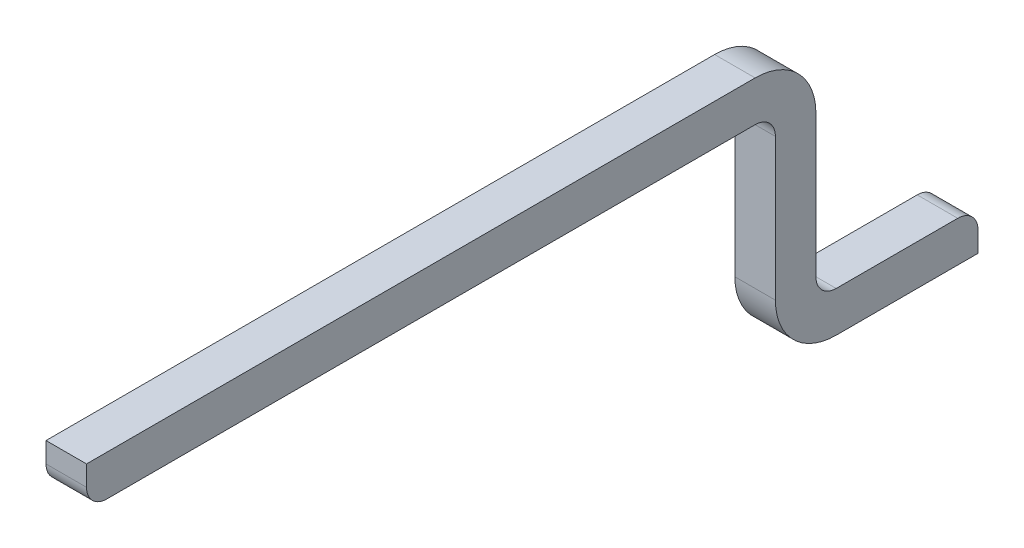
ISO-10303-21;
HEADER;
FILE_DESCRIPTION(('STEP AP214'),'2;1');
FILE_NAME('part.step','',(''),(''),'','','');
FILE_SCHEMA(('AUTOMOTIVE_DESIGN { 1 0 10303 214 1 1 1 1 }'));
ENDSEC;
DATA;
#1=APPLICATION_CONTEXT('core data for automotive mechanical design processes');
#2=APPLICATION_PROTOCOL_DEFINITION('international standard','automotive_design',2000,#1);
#3=PRODUCT_CONTEXT('',#1,'mechanical');
#4=PRODUCT('Part','Part','',(#3));
#5=PRODUCT_RELATED_PRODUCT_CATEGORY('part','',(#4));
#6=PRODUCT_DEFINITION_FORMATION('','',#4);
#7=PRODUCT_DEFINITION_CONTEXT('part definition',#1,'design');
#8=PRODUCT_DEFINITION('design','',#6,#7);
#9=PRODUCT_DEFINITION_SHAPE('','',#8);
#10=(LENGTH_UNIT() NAMED_UNIT(*) SI_UNIT(.MILLI.,.METRE.));
#11=(NAMED_UNIT(*) PLANE_ANGLE_UNIT() SI_UNIT($,.RADIAN.));
#12=(NAMED_UNIT(*) SI_UNIT($,.STERADIAN.) SOLID_ANGLE_UNIT());
#13=UNCERTAINTY_MEASURE_WITH_UNIT(LENGTH_MEASURE(1.E-05),#10,'distance_accuracy_value','');
#14=(GEOMETRIC_REPRESENTATION_CONTEXT(3) GLOBAL_UNCERTAINTY_ASSIGNED_CONTEXT((#13)) GLOBAL_UNIT_ASSIGNED_CONTEXT((#10,
#11,#12)) REPRESENTATION_CONTEXT('',''));
#15=CARTESIAN_POINT('',(0.,0.,0.));
#16=DIRECTION('',(0.,0.,1.));
#17=DIRECTION('',(1.,0.,0.));
#18=AXIS2_PLACEMENT_3D('',#15,#16,#17);
#19=CARTESIAN_POINT('',(0.1,0.3,-4.5));
#20=DIRECTION('',(1.,0.,0.));
#21=DIRECTION('',(0.,0.,-1.));
#22=AXIS2_PLACEMENT_3D('',#19,#20,#21);
#23=PLANE('',#22);
#24=CARTESIAN_POINT('',(0.1,0.3,-4.5));
#25=DIRECTION('',(-1.,0.,0.));
#26=DIRECTION('',(0.,0.,1.));
#27=AXIS2_PLACEMENT_3D('',#24,#25,#26);
#28=CIRCLE('',#27,0.3);
#29=CARTESIAN_POINT('',(0.1,0.3,-4.2));
#30=VERTEX_POINT('',#29);
#31=CARTESIAN_POINT('',(0.1,0.,-4.5));
#32=VERTEX_POINT('',#31);
#33=EDGE_CURVE('E213',#30,#32,#28,.F.);
#34=ORIENTED_EDGE('',*,*,#33,.T.);
#35=DIRECTION('',(0.,0.,-1.));
#36=VECTOR('',#35,1.);
#37=CARTESIAN_POINT('',(0.1,0.,-4.5));
#38=LINE('',#37,#36);
#39=CARTESIAN_POINT('',(0.1,0.,-5.2));
#40=VERTEX_POINT('',#39);
#41=EDGE_CURVE('E111',#32,#40,#38,.T.);
#42=ORIENTED_EDGE('',*,*,#41,.T.);
#43=DIRECTION('',(0.,1.,0.));
#44=VECTOR('',#43,1.);
#45=CARTESIAN_POINT('',(0.1,0.3,-5.2));
#46=LINE('',#45,#44);
#47=CARTESIAN_POINT('',(0.1,0.1,-5.2));
#48=VERTEX_POINT('',#47);
#49=EDGE_CURVE('E108',#40,#48,#46,.T.);
#50=ORIENTED_EDGE('',*,*,#49,.T.);
#51=CARTESIAN_POINT('',(0.1,0.1,-5.1));
#52=DIRECTION('',(-1.,0.,0.));
#53=DIRECTION('',(0.,0.,1.));
#54=AXIS2_PLACEMENT_3D('',#51,#52,#53);
#55=CIRCLE('',#54,0.1);
#56=CARTESIAN_POINT('',(0.1,0.2,-5.1));
#57=VERTEX_POINT('',#56);
#58=EDGE_CURVE('E19',#48,#57,#55,.F.);
#59=ORIENTED_EDGE('',*,*,#58,.T.);
#60=DIRECTION('',(0.,0.,-1.));
#61=VECTOR('',#60,1.);
#62=CARTESIAN_POINT('',(0.1,0.2,-4.5));
#63=LINE('',#62,#61);
#64=CARTESIAN_POINT('',(0.1,0.2,-4.5));
#65=VERTEX_POINT('',#64);
#66=EDGE_CURVE('E219',#57,#65,#63,.F.);
#67=ORIENTED_EDGE('',*,*,#66,.T.);
#68=CARTESIAN_POINT('',(0.1,0.3,-4.5));
#69=DIRECTION('',(-1.,0.,0.));
#70=DIRECTION('',(0.,0.,1.));
#71=AXIS2_PLACEMENT_3D('',#68,#69,#70);
#72=CIRCLE('',#71,0.1);
#73=CARTESIAN_POINT('',(0.1,0.3,-4.4));
#74=VERTEX_POINT('',#73);
#75=EDGE_CURVE('E212',#65,#74,#72,.T.);
#76=ORIENTED_EDGE('',*,*,#75,.T.);
#77=DIRECTION('',(0.,1.,0.));
#78=VECTOR('',#77,1.);
#79=CARTESIAN_POINT('',(0.1,1.,-4.4));
#80=LINE('',#79,#78);
#81=CARTESIAN_POINT('',(0.1,1.,-4.4));
#82=VERTEX_POINT('',#81);
#83=EDGE_CURVE('E208',#82,#74,#80,.F.);
#84=ORIENTED_EDGE('',*,*,#83,.F.);
#85=CARTESIAN_POINT('',(0.1,1.,-4.1));
#86=DIRECTION('',(-1.,0.,0.));
#87=DIRECTION('',(0.,0.,1.));
#88=AXIS2_PLACEMENT_3D('',#85,#86,#87);
#89=CIRCLE('',#88,0.3);
#90=CARTESIAN_POINT('',(0.1,1.3,-4.1));
#91=VERTEX_POINT('',#90);
#92=EDGE_CURVE('E205',#91,#82,#89,.T.);
#93=ORIENTED_EDGE('',*,*,#92,.F.);
#94=DIRECTION('',(0.,0.,1.));
#95=VECTOR('',#94,1.);
#96=CARTESIAN_POINT('',(0.1,1.3,-0.8));
#97=LINE('',#96,#95);
#98=CARTESIAN_POINT('',(0.1,1.3,-0.8));
#99=VERTEX_POINT('',#98);
#100=EDGE_CURVE('E202',#99,#91,#97,.F.);
#101=ORIENTED_EDGE('',*,*,#100,.F.);
#102=DIRECTION('',(0.,-1.,0.));
#103=VECTOR('',#102,1.);
#104=CARTESIAN_POINT('',(0.1,1.1,-0.8));
#105=LINE('',#104,#103);
#106=CARTESIAN_POINT('',(0.1,1.2,-0.8));
#107=VERTEX_POINT('',#106);
#108=EDGE_CURVE('E197',#107,#99,#105,.F.);
#109=ORIENTED_EDGE('',*,*,#108,.F.);
#110=CARTESIAN_POINT('',(0.1,1.2,-0.9));
#111=DIRECTION('',(1.,0.,0.));
#112=DIRECTION('',(0.,0.,-1.));
#113=AXIS2_PLACEMENT_3D('',#110,#111,#112);
#114=CIRCLE('',#113,0.1);
#115=CARTESIAN_POINT('',(0.1,1.1,-0.9));
#116=VERTEX_POINT('',#115);
#117=EDGE_CURVE('E194',#116,#107,#114,.F.);
#118=ORIENTED_EDGE('',*,*,#117,.F.);
#119=DIRECTION('',(0.,0.,1.));
#120=VECTOR('',#119,1.);
#121=CARTESIAN_POINT('',(0.1,1.1,-0.8));
#122=LINE('',#121,#120);
#123=CARTESIAN_POINT('',(0.1,1.1,-4.1));
#124=VERTEX_POINT('',#123);
#125=EDGE_CURVE('E188',#116,#124,#122,.F.);
#126=ORIENTED_EDGE('',*,*,#125,.T.);
#127=CARTESIAN_POINT('',(0.1,1.,-4.1));
#128=DIRECTION('',(-1.,0.,0.));
#129=DIRECTION('',(0.,0.,1.));
#130=AXIS2_PLACEMENT_3D('',#127,#128,#129);
#131=CIRCLE('',#130,0.1);
#132=CARTESIAN_POINT('',(0.1,1.,-4.2));
#133=VERTEX_POINT('',#132);
#134=EDGE_CURVE('E218',#124,#133,#131,.T.);
#135=ORIENTED_EDGE('',*,*,#134,.T.);
#136=DIRECTION('',(0.,1.,0.));
#137=VECTOR('',#136,1.);
#138=CARTESIAN_POINT('',(0.1,0.3,-4.2));
#139=LINE('',#138,#137);
#140=EDGE_CURVE('E216',#133,#30,#139,.F.);
#141=ORIENTED_EDGE('',*,*,#140,.T.);
#142=EDGE_LOOP('',(#34,#42,#50,#59,#67,#76,#84,#93,#101,#109,#118,#126,#135,#141));
#143=FACE_BOUND('',#142,.T.);
#144=ADVANCED_FACE('F16',(#143),#23,.T.);
#145=CARTESIAN_POINT('',(0.1,0.3,-4.5));
#146=DIRECTION('',(-1.,0.,0.));
#147=DIRECTION('',(0.,0.,1.));
#148=AXIS2_PLACEMENT_3D('',#145,#146,#147);
#149=CYLINDRICAL_SURFACE('',#148,0.1);
#150=DIRECTION('',(-1.,0.,0.));
#151=VECTOR('',#150,1.);
#152=CARTESIAN_POINT('',(0.1,0.3,-4.4));
#153=LINE('',#152,#151);
#154=CARTESIAN_POINT('',(-0.1,0.3,-4.4));
#155=VERTEX_POINT('',#154);
#156=EDGE_CURVE('E206',#74,#155,#153,.T.);
#157=ORIENTED_EDGE('',*,*,#156,.F.);
#158=ORIENTED_EDGE('',*,*,#75,.F.);
#159=DIRECTION('',(1.,0.,0.));
#160=VECTOR('',#159,1.);
#161=CARTESIAN_POINT('',(0.1,0.2,-4.5));
#162=LINE('',#161,#160);
#163=CARTESIAN_POINT('',(-0.1,0.2,-4.5));
#164=VERTEX_POINT('',#163);
#165=EDGE_CURVE('E173',#164,#65,#162,.T.);
#166=ORIENTED_EDGE('',*,*,#165,.F.);
#167=CARTESIAN_POINT('',(-0.1,0.3,-4.5));
#168=DIRECTION('',(-1.,0.,0.));
#169=DIRECTION('',(0.,0.,1.));
#170=AXIS2_PLACEMENT_3D('',#167,#168,#169);
#171=CIRCLE('',#170,0.1);
#172=EDGE_CURVE('E171',#164,#155,#171,.T.);
#173=ORIENTED_EDGE('',*,*,#172,.T.);
#174=EDGE_LOOP('',(#157,#158,#166,#173));
#175=FACE_BOUND('',#174,.T.);
#176=ADVANCED_FACE('F285',(#175),#149,.F.);
#177=CARTESIAN_POINT('',(0.1,1.,-4.4));
#178=DIRECTION('',(0.,0.,-1.));
#179=DIRECTION('',(-1.,0.,0.));
#180=AXIS2_PLACEMENT_3D('',#177,#178,#179);
#181=PLANE('',#180);
#182=ORIENTED_EDGE('',*,*,#83,.T.);
#183=ORIENTED_EDGE('',*,*,#156,.T.);
#184=DIRECTION('',(0.,1.,0.));
#185=VECTOR('',#184,1.);
#186=CARTESIAN_POINT('',(-0.1,0.3,-4.4));
#187=LINE('',#186,#185);
#188=CARTESIAN_POINT('',(-0.1,1.,-4.4));
#189=VERTEX_POINT('',#188);
#190=EDGE_CURVE('E168',#155,#189,#187,.T.);
#191=ORIENTED_EDGE('',*,*,#190,.T.);
#192=DIRECTION('',(-1.,0.,0.));
#193=VECTOR('',#192,1.);
#194=CARTESIAN_POINT('',(0.1,1.,-4.4));
#195=LINE('',#194,#193);
#196=EDGE_CURVE('E203',#82,#189,#195,.T.);
#197=ORIENTED_EDGE('',*,*,#196,.F.);
#198=EDGE_LOOP('',(#182,#183,#191,#197));
#199=FACE_BOUND('',#198,.T.);
#200=ADVANCED_FACE('F281',(#199),#181,.T.);
#201=CARTESIAN_POINT('',(0.1,1.,-4.1));
#202=DIRECTION('',(-1.,0.,0.));
#203=DIRECTION('',(0.,0.,1.));
#204=AXIS2_PLACEMENT_3D('',#201,#202,#203);
#205=CYLINDRICAL_SURFACE('',#204,0.3);
#206=ORIENTED_EDGE('',*,*,#92,.T.);
#207=ORIENTED_EDGE('',*,*,#196,.T.);
#208=CARTESIAN_POINT('',(-0.1,1.,-4.1));
#209=DIRECTION('',(-1.,0.,0.));
#210=DIRECTION('',(0.,0.,1.));
#211=AXIS2_PLACEMENT_3D('',#208,#209,#210);
#212=CIRCLE('',#211,0.3);
#213=CARTESIAN_POINT('',(-0.1,1.3,-4.1));
#214=VERTEX_POINT('',#213);
#215=EDGE_CURVE('E165',#189,#214,#212,.F.);
#216=ORIENTED_EDGE('',*,*,#215,.T.);
#217=DIRECTION('',(1.,0.,0.));
#218=VECTOR('',#217,1.);
#219=CARTESIAN_POINT('',(0.1,1.3,-4.1));
#220=LINE('',#219,#218);
#221=EDGE_CURVE('E200',#91,#214,#220,.F.);
#222=ORIENTED_EDGE('',*,*,#221,.F.);
#223=EDGE_LOOP('',(#206,#207,#216,#222));
#224=FACE_BOUND('',#223,.T.);
#225=ADVANCED_FACE('F277',(#224),#205,.T.);
#226=CARTESIAN_POINT('',(0.1,1.3,-0.8));
#227=DIRECTION('',(0.,1.,0.));
#228=DIRECTION('',(0.,0.,1.));
#229=AXIS2_PLACEMENT_3D('',#226,#227,#228);
#230=PLANE('',#229);
#231=ORIENTED_EDGE('',*,*,#100,.T.);
#232=ORIENTED_EDGE('',*,*,#221,.T.);
#233=DIRECTION('',(0.,0.,-1.));
#234=VECTOR('',#233,1.);
#235=CARTESIAN_POINT('',(-0.1,1.3,-4.5));
#236=LINE('',#235,#234);
#237=CARTESIAN_POINT('',(-0.1,1.3,-0.8));
#238=VERTEX_POINT('',#237);
#239=EDGE_CURVE('E160',#214,#238,#236,.F.);
#240=ORIENTED_EDGE('',*,*,#239,.T.);
#241=DIRECTION('',(1.,0.,0.));
#242=VECTOR('',#241,1.);
#243=CARTESIAN_POINT('',(0.1,1.3,-0.8));
#244=LINE('',#243,#242);
#245=EDGE_CURVE('E195',#99,#238,#244,.F.);
#246=ORIENTED_EDGE('',*,*,#245,.F.);
#247=EDGE_LOOP('',(#231,#232,#240,#246));
#248=FACE_BOUND('',#247,.T.);
#249=ADVANCED_FACE('F271',(#248),#230,.T.);
#250=CARTESIAN_POINT('',(0.1,1.1,-0.8));
#251=DIRECTION('',(0.,0.,1.));
#252=DIRECTION('',(0.,-1.,0.));
#253=AXIS2_PLACEMENT_3D('',#250,#251,#252);
#254=PLANE('',#253);
#255=ORIENTED_EDGE('',*,*,#108,.T.);
#256=ORIENTED_EDGE('',*,*,#245,.T.);
#257=DIRECTION('',(0.,1.,0.));
#258=VECTOR('',#257,1.);
#259=CARTESIAN_POINT('',(-0.1,0.3,-0.8));
#260=LINE('',#259,#258);
#261=CARTESIAN_POINT('',(-0.1,1.2,-0.8));
#262=VERTEX_POINT('',#261);
#263=EDGE_CURVE('E157',#238,#262,#260,.F.);
#264=ORIENTED_EDGE('',*,*,#263,.T.);
#265=DIRECTION('',(1.,0.,0.));
#266=VECTOR('',#265,1.);
#267=CARTESIAN_POINT('',(0.1,1.2,-0.8));
#268=LINE('',#267,#266);
#269=EDGE_CURVE('E192',#107,#262,#268,.F.);
#270=ORIENTED_EDGE('',*,*,#269,.F.);
#271=EDGE_LOOP('',(#255,#256,#264,#270));
#272=FACE_BOUND('',#271,.T.);
#273=ADVANCED_FACE('F267',(#272),#254,.T.);
#274=CARTESIAN_POINT('',(0.1,1.2,-0.9));
#275=DIRECTION('',(1.,0.,0.));
#276=DIRECTION('',(0.,0.,-1.));
#277=AXIS2_PLACEMENT_3D('',#274,#275,#276);
#278=CYLINDRICAL_SURFACE('',#277,0.1);
#279=CARTESIAN_POINT('',(-0.1,1.2,-0.9));
#280=DIRECTION('',(1.,0.,0.));
#281=DIRECTION('',(0.,0.,-1.));
#282=AXIS2_PLACEMENT_3D('',#279,#280,#281);
#283=CIRCLE('',#282,0.1);
#284=CARTESIAN_POINT('',(-0.1,1.1,-0.9));
#285=VERTEX_POINT('',#284);
#286=EDGE_CURVE('E156',#262,#285,#283,.T.);
#287=ORIENTED_EDGE('',*,*,#286,.T.);
#288=DIRECTION('',(1.,0.,0.));
#289=VECTOR('',#288,1.);
#290=CARTESIAN_POINT('',(0.1,1.1,-0.9));
#291=LINE('',#290,#289);
#292=EDGE_CURVE('E189',#285,#116,#291,.T.);
#293=ORIENTED_EDGE('',*,*,#292,.T.);
#294=ORIENTED_EDGE('',*,*,#117,.T.);
#295=ORIENTED_EDGE('',*,*,#269,.T.);
#296=EDGE_LOOP('',(#287,#293,#294,#295));
#297=FACE_BOUND('',#296,.T.);
#298=ADVANCED_FACE('F261',(#297),#278,.T.);
#299=CARTESIAN_POINT('',(0.1,1.1,-0.8));
#300=DIRECTION('',(0.,1.,0.));
#301=DIRECTION('',(0.,0.,1.));
#302=AXIS2_PLACEMENT_3D('',#299,#300,#301);
#303=PLANE('',#302);
#304=ORIENTED_EDGE('',*,*,#292,.F.);
#305=DIRECTION('',(0.,0.,-1.));
#306=VECTOR('',#305,1.);
#307=CARTESIAN_POINT('',(-0.1,1.1,-4.5));
#308=LINE('',#307,#306);
#309=CARTESIAN_POINT('',(-0.1,1.1,-4.1));
#310=VERTEX_POINT('',#309);
#311=EDGE_CURVE('E153',#285,#310,#308,.T.);
#312=ORIENTED_EDGE('',*,*,#311,.T.);
#313=DIRECTION('',(-1.,0.,0.));
#314=VECTOR('',#313,1.);
#315=CARTESIAN_POINT('',(0.1,1.1,-4.1));
#316=LINE('',#315,#314);
#317=EDGE_CURVE('E185',#310,#124,#316,.F.);
#318=ORIENTED_EDGE('',*,*,#317,.T.);
#319=ORIENTED_EDGE('',*,*,#125,.F.);
#320=EDGE_LOOP('',(#304,#312,#318,#319));
#321=FACE_BOUND('',#320,.T.);
#322=ADVANCED_FACE('F259',(#321),#303,.F.);
#323=CARTESIAN_POINT('',(0.1,1.,-4.1));
#324=DIRECTION('',(-1.,0.,0.));
#325=DIRECTION('',(0.,0.,1.));
#326=AXIS2_PLACEMENT_3D('',#323,#324,#325);
#327=CYLINDRICAL_SURFACE('',#326,0.1);
#328=DIRECTION('',(-1.,0.,0.));
#329=VECTOR('',#328,1.);
#330=CARTESIAN_POINT('',(0.1,1.,-4.2));
#331=LINE('',#330,#329);
#332=CARTESIAN_POINT('',(-0.1,1.,-4.2));
#333=VERTEX_POINT('',#332);
#334=EDGE_CURVE('E182',#333,#133,#331,.F.);
#335=ORIENTED_EDGE('',*,*,#334,.T.);
#336=ORIENTED_EDGE('',*,*,#134,.F.);
#337=ORIENTED_EDGE('',*,*,#317,.F.);
#338=CARTESIAN_POINT('',(-0.1,1.,-4.1));
#339=DIRECTION('',(-1.,0.,0.));
#340=DIRECTION('',(0.,0.,1.));
#341=AXIS2_PLACEMENT_3D('',#338,#339,#340);
#342=CIRCLE('',#341,0.1);
#343=EDGE_CURVE('E152',#310,#333,#342,.T.);
#344=ORIENTED_EDGE('',*,*,#343,.T.);
#345=EDGE_LOOP('',(#335,#336,#337,#344));
#346=FACE_BOUND('',#345,.T.);
#347=ADVANCED_FACE('F248',(#346),#327,.F.);
#348=CARTESIAN_POINT('',(0.1,1.,-4.2));
#349=DIRECTION('',(0.,0.,-1.));
#350=DIRECTION('',(-1.,0.,0.));
#351=AXIS2_PLACEMENT_3D('',#348,#349,#350);
#352=PLANE('',#351);
#353=DIRECTION('',(-1.,0.,0.));
#354=VECTOR('',#353,1.);
#355=CARTESIAN_POINT('',(0.1,0.3,-4.2));
#356=LINE('',#355,#354);
#357=CARTESIAN_POINT('',(-0.1,0.3,-4.2));
#358=VERTEX_POINT('',#357);
#359=EDGE_CURVE('E180',#30,#358,#356,.T.);
#360=ORIENTED_EDGE('',*,*,#359,.F.);
#361=ORIENTED_EDGE('',*,*,#140,.F.);
#362=ORIENTED_EDGE('',*,*,#334,.F.);
#363=DIRECTION('',(0.,1.,0.));
#364=VECTOR('',#363,1.);
#365=CARTESIAN_POINT('',(-0.1,0.3,-4.2));
#366=LINE('',#365,#364);
#367=EDGE_CURVE('E143',#333,#358,#366,.F.);
#368=ORIENTED_EDGE('',*,*,#367,.T.);
#369=EDGE_LOOP('',(#360,#361,#362,#368));
#370=FACE_BOUND('',#369,.T.);
#371=ADVANCED_FACE('F252',(#370),#352,.F.);
#372=CARTESIAN_POINT('',(0.1,0.3,-4.5));
#373=DIRECTION('',(-1.,0.,0.));
#374=DIRECTION('',(0.,0.,1.));
#375=AXIS2_PLACEMENT_3D('',#372,#373,#374);
#376=CYLINDRICAL_SURFACE('',#375,0.3);
#377=ORIENTED_EDGE('',*,*,#33,.F.);
#378=ORIENTED_EDGE('',*,*,#359,.T.);
#379=CARTESIAN_POINT('',(-0.1,0.3,-4.5));
#380=DIRECTION('',(-1.,0.,0.));
#381=DIRECTION('',(0.,0.,1.));
#382=AXIS2_PLACEMENT_3D('',#379,#380,#381);
#383=CIRCLE('',#382,0.3);
#384=CARTESIAN_POINT('',(-0.1,0.,-4.5));
#385=VERTEX_POINT('',#384);
#386=EDGE_CURVE('E141',#358,#385,#383,.F.);
#387=ORIENTED_EDGE('',*,*,#386,.T.);
#388=DIRECTION('',(1.,0.,0.));
#389=VECTOR('',#388,1.);
#390=CARTESIAN_POINT('',(0.1,0.,-4.5));
#391=LINE('',#390,#389);
#392=EDGE_CURVE('E128',#385,#32,#391,.T.);
#393=ORIENTED_EDGE('',*,*,#392,.T.);
#394=EDGE_LOOP('',(#377,#378,#387,#393));
#395=FACE_BOUND('',#394,.T.);
#396=ADVANCED_FACE('F255',(#395),#376,.T.);
#397=CARTESIAN_POINT('',(0.1,0.,-4.5));
#398=DIRECTION('',(0.,1.,0.));
#399=DIRECTION('',(0.,0.,1.));
#400=AXIS2_PLACEMENT_3D('',#397,#398,#399);
#401=PLANE('',#400);
#402=DIRECTION('',(-1.,0.,0.));
#403=VECTOR('',#402,1.);
#404=CARTESIAN_POINT('',(0.1,0.,-5.2));
#405=LINE('',#404,#403);
#406=CARTESIAN_POINT('',(-0.1,0.,-5.2));
#407=VERTEX_POINT('',#406);
#408=EDGE_CURVE('E121',#40,#407,#405,.T.);
#409=ORIENTED_EDGE('',*,*,#408,.F.);
#410=ORIENTED_EDGE('',*,*,#41,.F.);
#411=ORIENTED_EDGE('',*,*,#392,.F.);
#412=DIRECTION('',(0.,0.,-1.));
#413=VECTOR('',#412,1.);
#414=CARTESIAN_POINT('',(-0.1,0.,-4.5));
#415=LINE('',#414,#413);
#416=EDGE_CURVE('E135',#385,#407,#415,.T.);
#417=ORIENTED_EDGE('',*,*,#416,.T.);
#418=EDGE_LOOP('',(#409,#410,#411,#417));
#419=FACE_BOUND('',#418,.T.);
#420=ADVANCED_FACE('F139',(#419),#401,.F.);
#421=CARTESIAN_POINT('',(0.1,0.2,-5.2));
#422=DIRECTION('',(0.,0.,-1.));
#423=DIRECTION('',(-1.,0.,0.));
#424=AXIS2_PLACEMENT_3D('',#421,#422,#423);
#425=PLANE('',#424);
#426=ORIENTED_EDGE('',*,*,#49,.F.);
#427=ORIENTED_EDGE('',*,*,#408,.T.);
#428=DIRECTION('',(0.,1.,0.));
#429=VECTOR('',#428,1.);
#430=CARTESIAN_POINT('',(-0.1,0.3,-5.2));
#431=LINE('',#430,#429);
#432=CARTESIAN_POINT('',(-0.1,0.1,-5.2));
#433=VERTEX_POINT('',#432);
#434=EDGE_CURVE('E124',#407,#433,#431,.T.);
#435=ORIENTED_EDGE('',*,*,#434,.T.);
#436=DIRECTION('',(-1.,0.,0.));
#437=VECTOR('',#436,1.);
#438=CARTESIAN_POINT('',(0.1,0.1,-5.2));
#439=LINE('',#438,#437);
#440=EDGE_CURVE('E127',#48,#433,#439,.T.);
#441=ORIENTED_EDGE('',*,*,#440,.F.);
#442=EDGE_LOOP('',(#426,#427,#435,#441));
#443=FACE_BOUND('',#442,.T.);
#444=ADVANCED_FACE('F123',(#443),#425,.T.);
#445=CARTESIAN_POINT('',(0.1,0.1,-5.1));
#446=DIRECTION('',(-1.,0.,0.));
#447=DIRECTION('',(0.,0.,1.));
#448=AXIS2_PLACEMENT_3D('',#445,#446,#447);
#449=CYLINDRICAL_SURFACE('',#448,0.1);
#450=CARTESIAN_POINT('',(-0.1,0.1,-5.1));
#451=DIRECTION('',(-1.,0.,0.));
#452=DIRECTION('',(0.,0.,1.));
#453=AXIS2_PLACEMENT_3D('',#450,#451,#452);
#454=CIRCLE('',#453,0.1);
#455=CARTESIAN_POINT('',(-0.1,0.2,-5.1));
#456=VERTEX_POINT('',#455);
#457=EDGE_CURVE('E25',#433,#456,#454,.F.);
#458=ORIENTED_EDGE('',*,*,#457,.T.);
#459=DIRECTION('',(1.,0.,0.));
#460=VECTOR('',#459,1.);
#461=CARTESIAN_POINT('',(0.1,0.2,-5.1));
#462=LINE('',#461,#460);
#463=EDGE_CURVE('E33',#57,#456,#462,.F.);
#464=ORIENTED_EDGE('',*,*,#463,.F.);
#465=ORIENTED_EDGE('',*,*,#58,.F.);
#466=ORIENTED_EDGE('',*,*,#440,.T.);
#467=EDGE_LOOP('',(#458,#464,#465,#466));
#468=FACE_BOUND('',#467,.T.);
#469=ADVANCED_FACE('F289',(#468),#449,.T.);
#470=CARTESIAN_POINT('',(0.1,0.2,-4.5));
#471=DIRECTION('',(0.,1.,0.));
#472=DIRECTION('',(0.,0.,1.));
#473=AXIS2_PLACEMENT_3D('',#470,#471,#472);
#474=PLANE('',#473);
#475=DIRECTION('',(0.,0.,-1.));
#476=VECTOR('',#475,1.);
#477=CARTESIAN_POINT('',(-0.1,0.2,-4.5));
#478=LINE('',#477,#476);
#479=EDGE_CURVE('E10',#456,#164,#478,.F.);
#480=ORIENTED_EDGE('',*,*,#479,.T.);
#481=ORIENTED_EDGE('',*,*,#165,.T.);
#482=ORIENTED_EDGE('',*,*,#66,.F.);
#483=ORIENTED_EDGE('',*,*,#463,.T.);
#484=EDGE_LOOP('',(#480,#481,#482,#483));
#485=FACE_BOUND('',#484,.T.);
#486=ADVANCED_FACE('F287',(#485),#474,.T.);
#487=CARTESIAN_POINT('',(-0.1,0.3,-4.5));
#488=DIRECTION('',(1.,0.,0.));
#489=DIRECTION('',(0.,0.,-1.));
#490=AXIS2_PLACEMENT_3D('',#487,#488,#489);
#491=PLANE('',#490);
#492=ORIENTED_EDGE('',*,*,#457,.F.);
#493=ORIENTED_EDGE('',*,*,#434,.F.);
#494=ORIENTED_EDGE('',*,*,#416,.F.);
#495=ORIENTED_EDGE('',*,*,#386,.F.);
#496=ORIENTED_EDGE('',*,*,#367,.F.);
#497=ORIENTED_EDGE('',*,*,#343,.F.);
#498=ORIENTED_EDGE('',*,*,#311,.F.);
#499=ORIENTED_EDGE('',*,*,#286,.F.);
#500=ORIENTED_EDGE('',*,*,#263,.F.);
#501=ORIENTED_EDGE('',*,*,#239,.F.);
#502=ORIENTED_EDGE('',*,*,#215,.F.);
#503=ORIENTED_EDGE('',*,*,#190,.F.);
#504=ORIENTED_EDGE('',*,*,#172,.F.);
#505=ORIENTED_EDGE('',*,*,#479,.F.);
#506=EDGE_LOOP('',(#492,#493,#494,#495,#496,#497,#498,#499,#500,#501,#502,#503,#504,#505));
#507=FACE_BOUND('',#506,.T.);
#508=ADVANCED_FACE('F133',(#507),#491,.F.);
#509=CLOSED_SHELL('',(#144,#176,#200,#225,#249,#273,#298,#322,#347,#371,#396,#420,#444,#469,
#486,#508));
#510=MANIFOLD_SOLID_BREP('B1',#509);
#511=ADVANCED_BREP_SHAPE_REPRESENTATION('',(#18,#510),#14);
#512=SHAPE_DEFINITION_REPRESENTATION(#9,#511);
ENDSEC;
END-ISO-10303-21;
